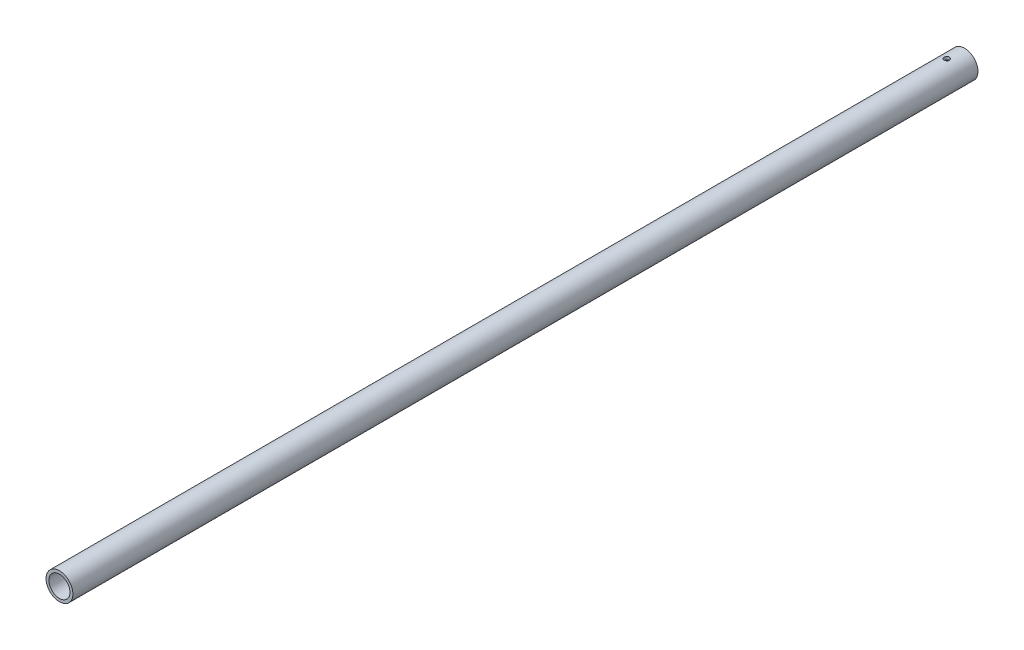
ISO-10303-21;
HEADER;
FILE_DESCRIPTION(('STEP AP214'),'2;1');
FILE_NAME('part.step','',(''),(''),'','','');
FILE_SCHEMA(('AUTOMOTIVE_DESIGN { 1 0 10303 214 1 1 1 1 }'));
ENDSEC;
DATA;
#1=APPLICATION_CONTEXT('core data for automotive mechanical design processes');
#2=APPLICATION_PROTOCOL_DEFINITION('international standard','automotive_design',2000,#1);
#3=PRODUCT_CONTEXT('',#1,'mechanical');
#4=PRODUCT('Part','Part','',(#3));
#5=PRODUCT_RELATED_PRODUCT_CATEGORY('part','',(#4));
#6=PRODUCT_DEFINITION_FORMATION('','',#4);
#7=PRODUCT_DEFINITION_CONTEXT('part definition',#1,'design');
#8=PRODUCT_DEFINITION('design','',#6,#7);
#9=PRODUCT_DEFINITION_SHAPE('','',#8);
#10=(LENGTH_UNIT() NAMED_UNIT(*) SI_UNIT(.MILLI.,.METRE.));
#11=(NAMED_UNIT(*) PLANE_ANGLE_UNIT() SI_UNIT($,.RADIAN.));
#12=(NAMED_UNIT(*) SI_UNIT($,.STERADIAN.) SOLID_ANGLE_UNIT());
#13=UNCERTAINTY_MEASURE_WITH_UNIT(LENGTH_MEASURE(1.E-05),#10,'distance_accuracy_value','');
#14=(GEOMETRIC_REPRESENTATION_CONTEXT(3) GLOBAL_UNCERTAINTY_ASSIGNED_CONTEXT((#13)) GLOBAL_UNIT_ASSIGNED_CONTEXT((#10,
#11,#12)) REPRESENTATION_CONTEXT('',''));
#15=CARTESIAN_POINT('',(0.,0.,0.));
#16=DIRECTION('',(0.,0.,1.));
#17=DIRECTION('',(1.,0.,0.));
#18=AXIS2_PLACEMENT_3D('',#15,#16,#17);
#19=CARTESIAN_POINT('',(-587.375,0.,44.448));
#20=DIRECTION('',(0.,0.,-1.));
#21=DIRECTION('',(0.,1.,0.));
#22=AXIS2_PLACEMENT_3D('',#19,#20,#21);
#23=CYLINDRICAL_SURFACE('',#22,13.0683);
#24=CARTESIAN_POINT('',(-587.375,2.22044604925031E-13,1168.4));
#25=DIRECTION('',(0.,0.,-1.));
#26=DIRECTION('',(0.,1.,0.));
#27=AXIS2_PLACEMENT_3D('',#24,#25,#26);
#28=CIRCLE('',#27,13.0683);
#29=CARTESIAN_POINT('',(-587.375,13.0683000000002,1168.4));
#30=VERTEX_POINT('',#29);
#31=EDGE_CURVE('E66',#30,#30,#28,.T.);
#32=ORIENTED_EDGE('',*,*,#31,.F.);
#33=EDGE_LOOP('',(#32));
#34=FACE_BOUND('',#33,.T.);
#35=CARTESIAN_POINT('',(-587.375,0.,44.45));
#36=DIRECTION('',(0.,0.,-1.));
#37=DIRECTION('',(0.,1.,0.));
#38=AXIS2_PLACEMENT_3D('',#35,#36,#37);
#39=CIRCLE('',#38,13.0683);
#40=CARTESIAN_POINT('',(-587.375,13.0683,44.45));
#41=VERTEX_POINT('',#40);
#42=EDGE_CURVE('E64',#41,#41,#39,.T.);
#43=ORIENTED_EDGE('',*,*,#42,.T.);
#44=EDGE_LOOP('',(#43));
#45=FACE_BOUND('',#44,.T.);
#46=CARTESIAN_POINT('',(-587.53833139634,13.0672794580307,63.3770418377689));
#47=CARTESIAN_POINT('',(-587.721100575177,13.0649918849138,63.3860987090218));
#48=CARTESIAN_POINT('',(-587.903125717905,13.0588464757121,63.4103905161322));
#49=CARTESIAN_POINT('',(-588.260354937121,13.0395046616244,63.4886492078556));
#50=CARTESIAN_POINT('',(-588.435554738759,13.0263039116557,63.5426343799399));
#51=CARTESIAN_POINT('',(-588.77396819349,12.9943149607709,63.6784535629161));
#52=CARTESIAN_POINT('',(-588.937197261757,12.975534108888,63.7602509652374));
#53=CARTESIAN_POINT('',(-589.247650307495,12.9343806292755,63.9493024055775));
#54=CARTESIAN_POINT('',(-589.394873854641,12.9120079050147,64.0565571277961));
#55=CARTESIAN_POINT('',(-589.672323929617,12.8655728852785,64.295980331765));
#56=CARTESIAN_POINT('',(-589.802160405314,12.8414860563161,64.4285962413922));
#57=CARTESIAN_POINT('',(-590.037940111511,12.7946746606322,64.7138281230409));
#58=CARTESIAN_POINT('',(-590.143881384593,12.7719502056239,64.8664457319194));
#59=CARTESIAN_POINT('',(-590.329824090898,12.7302272865214,65.1893146141167));
#60=CARTESIAN_POINT('',(-590.409554512781,12.7112685065847,65.3597274914947));
#61=CARTESIAN_POINT('',(-590.53906341514,12.679654978147,65.712125939414));
#62=CARTESIAN_POINT('',(-590.58884776111,12.6669989952097,65.8941092359479));
#63=CARTESIAN_POINT('',(-590.655924704754,12.649789709017,66.259743779684));
#64=CARTESIAN_POINT('',(-590.673980231583,12.6450462924839,66.4432460639722));
#65=CARTESIAN_POINT('',(-590.67932140654,12.6436521128186,66.8107149946973));
#66=CARTESIAN_POINT('',(-590.666611064706,12.6470002950238,66.9946815774951));
#67=CARTESIAN_POINT('',(-590.611467642253,12.6612206904028,67.3538266272606));
#68=CARTESIAN_POINT('',(-590.569661855967,12.6719340527542,67.5291084268457));
#69=CARTESIAN_POINT('',(-590.458350744913,12.6994753954826,67.8701289398293));
#70=CARTESIAN_POINT('',(-590.388842641932,12.7163039891297,68.0358666941648));
#71=CARTESIAN_POINT('',(-590.222872080421,12.7545059873789,68.3560282089219));
#72=CARTESIAN_POINT('',(-590.126001336057,12.7759469598428,68.5102319945485));
#73=CARTESIAN_POINT('',(-589.908452668902,12.8208576342404,68.800495447915));
#74=CARTESIAN_POINT('',(-589.787770561949,12.8443276923198,68.936551919734));
#75=CARTESIAN_POINT('',(-589.522037692798,12.8914454612849,69.1905800220592));
#76=CARTESIAN_POINT('',(-589.376403312444,12.9150800081957,69.3079445608181));
#77=CARTESIAN_POINT('',(-589.067095830384,12.9592301014388,69.516622096199));
#78=CARTESIAN_POINT('',(-588.903422957507,12.9797456873291,69.6079354232433));
#79=CARTESIAN_POINT('',(-588.562887862752,13.015321448744,69.7615721780566));
#80=CARTESIAN_POINT('',(-588.386057845694,13.0303944486118,69.8239638536427));
#81=CARTESIAN_POINT('',(-588.023965759115,13.0534354314761,69.9179949727274));
#82=CARTESIAN_POINT('',(-587.838705398,13.0614048473306,69.9496406180988));
#83=CARTESIAN_POINT('',(-587.470465198862,13.0692134660738,69.9806458710513));
#84=CARTESIAN_POINT('',(-587.287562148187,13.0692696369355,69.9808670855184));
#85=CARTESIAN_POINT('',(-586.924388130666,13.0617916131985,69.9511780752197));
#86=CARTESIAN_POINT('',(-586.744117009113,13.0542578665756,69.9212696287814));
#87=CARTESIAN_POINT('',(-586.393169602602,13.032539900263,69.8327896140948));
#88=CARTESIAN_POINT('',(-586.22241404998,13.0184244784369,69.7745142924446));
#89=CARTESIAN_POINT('',(-585.893057408581,12.9850583447726,69.6312330080142));
#90=CARTESIAN_POINT('',(-585.734457842766,12.9658069908288,69.5462237026547));
#91=CARTESIAN_POINT('',(-585.430131395502,12.9237024935997,69.3497352770919));
#92=CARTESIAN_POINT('',(-585.284761364524,12.9007798613018,69.237718533856));
#93=CARTESIAN_POINT('',(-585.014589863136,12.8540951157267,68.9912712702386));
#94=CARTESIAN_POINT('',(-584.88979177949,12.8303328650034,68.8568370665792));
#95=CARTESIAN_POINT('',(-584.661497546505,12.7840239470593,68.5657836440177));
#96=CARTESIAN_POINT('',(-584.558536210482,12.7615160110318,68.4087379277813));
#97=CARTESIAN_POINT('',(-584.380506156113,12.7209216856486,68.079029970687));
#98=CARTESIAN_POINT('',(-584.305434799374,12.702834878109,67.9063692089362));
#99=CARTESIAN_POINT('',(-584.186290321569,12.6734504080024,67.5523784229988));
#100=CARTESIAN_POINT('',(-584.141862176946,12.6620752178238,67.3711746054304));
#101=CARTESIAN_POINT('',(-584.084127536147,12.6471948096971,67.0035720865853));
#102=CARTESIAN_POINT('',(-584.070814505839,12.6436879394186,66.8171744843177));
#103=CARTESIAN_POINT('',(-584.075700142981,12.6449625118701,66.4502100803065));
#104=CARTESIAN_POINT('',(-584.09300324239,12.6495084036047,66.2696298094733));
#105=CARTESIAN_POINT('',(-584.156802638161,12.6658888096666,65.9140544486865));
#106=CARTESIAN_POINT('',(-584.20329939915,12.6777234399964,65.739059447671));
#107=CARTESIAN_POINT('',(-584.323984701052,12.7073049506421,65.3994652914132));
#108=CARTESIAN_POINT('',(-584.398171860142,12.7250515359311,65.234865617896));
#109=CARTESIAN_POINT('',(-584.572066926928,12.7644800387478,64.9202671978276));
#110=CARTESIAN_POINT('',(-584.671778777362,12.7861625640997,64.7702707119397));
#111=CARTESIAN_POINT('',(-584.897258118407,12.8317899206001,64.4845536549164));
#112=CARTESIAN_POINT('',(-585.023689003785,12.85578170639,64.3493638008059));
#113=CARTESIAN_POINT('',(-585.29744706586,12.9028483781541,64.1018628539771));
#114=CARTESIAN_POINT('',(-585.444778608573,12.9259230712608,63.989556553462));
#115=CARTESIAN_POINT('',(-585.758616044931,12.9689307393484,63.7895895845661));
#116=CARTESIAN_POINT('',(-585.925354810472,12.9888168802093,63.7022836846445));
#117=CARTESIAN_POINT('',(-586.271670025502,13.0227993236423,63.5571388483491));
#118=CARTESIAN_POINT('',(-586.45123670829,13.0368999770555,63.4992777607918));
#119=CARTESIAN_POINT('',(-586.782258214127,13.0556911874934,63.4230983554607));
#120=CARTESIAN_POINT('',(-586.93239796088,13.0616776141806,63.399282047039));
#121=CARTESIAN_POINT('',(-587.234639630717,13.068420249987,63.3724985258837));
#122=CARTESIAN_POINT('',(-587.386741430452,13.0691767863053,63.3695300088433));
#123=CARTESIAN_POINT('',(-587.53833139634,13.0672794580307,63.3770418377689));
#124=B_SPLINE_CURVE_WITH_KNOTS('',3,(#46,#47,#48,#49,#50,#51,#52,#53,#54,#55,#56,#57,#58,#59,
#60,#61,#62,#63,#64,#65,#66,#67,#68,#69,#70,#71,#72,#73,#74,#75,#76,#77,#78,#79,#80,#81,#82,#83,
#84,#85,#86,#87,#88,#89,#90,#91,#92,#93,#94,#95,#96,#97,#98,#99,#100,#101,#102,#103,#104,#105,
#106,#107,#108,#109,#110,#111,#112,#113,#114,#115,#116,#117,#118,#119,#120,#121,#122,#123),
.UNSPECIFIED.,.T.,.F.,(4,2,2,2,2,2,2,2,2,2,2,2,2,2,2,2,2,2,2,2,2,2,2,2,2,2,2,2,2,2,2,2,2,2,2,2,
2,2,4),(0.,0.54846367460348,1.09726551441117,1.64534775819881,2.19344473410384,2.75229291139326,
3.31118685111387,3.8756900209641,4.44008258635914,4.99070828918085,5.54126222707507,
6.08029981399044,6.6193914735787,7.16699553428746,7.71469590649142,8.27760490641119,
8.84050676631503,9.40207347149972,9.96352687787038,10.5095830869399,11.0556070683037,
11.5960472227399,12.1365549758874,12.6888690926608,13.2412740464139,13.8059507217746,
14.3705739650622,14.9285405014959,15.4863898551642,16.0281899579808,16.5699986839388,
17.1117803758291,17.6536458059419,18.2110022980092,18.7684753902674,19.3335062780449,
19.8981114652145,20.3530393268949,20.8079387265286),.UNSPECIFIED.);
#125=CARTESIAN_POINT('',(-587.53833139634,13.0672794580307,63.3770418377689));
#126=VERTEX_POINT('',#125);
#127=EDGE_CURVE('E16',#126,#126,#124,.T.);
#128=ORIENTED_EDGE('',*,*,#127,.T.);
#129=EDGE_LOOP('',(#128));
#130=FACE_BOUND('',#129,.T.);
#131=CARTESIAN_POINT('',(-587.211673948654,-13.0672795312399,63.3770415666532));
#132=CARTESIAN_POINT('',(-587.028904776288,-13.0649920335342,63.3860981400632));
#133=CARTESIAN_POINT('',(-586.846879614047,-13.0588466938023,63.4103896527));
#134=CARTESIAN_POINT('',(-586.489650302736,-13.0395050160975,63.4886477548916));
#135=CARTESIAN_POINT('',(-586.314450428486,-13.0263043330386,63.542632631925));
#136=CARTESIAN_POINT('',(-585.976036780042,-12.994315497913,63.6784512414632));
#137=CARTESIAN_POINT('',(-585.812807590757,-12.9755346948942,63.7602483654204));
#138=CARTESIAN_POINT('',(-585.502354259171,-12.9343812919573,63.9492992694329));
#139=CARTESIAN_POINT('',(-585.355130547178,-12.9120085955111,64.0565537336624));
#140=CARTESIAN_POINT('',(-585.077680100561,-12.8655736069627,64.2959764416947));
#141=CARTESIAN_POINT('',(-584.947843417043,-12.8414867808928,64.4285921136239));
#142=CARTESIAN_POINT('',(-584.712063256288,-12.7946753636715,64.7138235525568));
#143=CARTESIAN_POINT('',(-584.606121736512,-12.7719508842337,64.8664409564573));
#144=CARTESIAN_POINT('',(-584.420178482452,-12.7302278859752,65.1893094955277));
#145=CARTESIAN_POINT('',(-584.340447764008,-12.7112690517587,65.3597222380548));
#146=CARTESIAN_POINT('',(-584.210938249358,-12.6796553951483,65.7121204690211));
#147=CARTESIAN_POINT('',(-584.161153587682,-12.6669993383261,65.8941036834502));
#148=CARTESIAN_POINT('',(-584.094076007159,-12.6497898945543,66.2597381432175));
#149=CARTESIAN_POINT('',(-584.076020162878,-12.6450463954567,66.4432404249259));
#150=CARTESIAN_POINT('',(-584.070678362298,-12.6436520524858,66.8107094065577));
#151=CARTESIAN_POINT('',(-584.083388395925,-12.6470001539399,66.994676042834));
#152=CARTESIAN_POINT('',(-584.138531224017,-12.6612203999228,67.3538212235215));
#153=CARTESIAN_POINT('',(-584.180336719478,-12.6719336923103,67.5291031001822));
#154=CARTESIAN_POINT('',(-584.29164726759,-12.6994749116334,67.8701238133535));
#155=CARTESIAN_POINT('',(-584.361155098432,-12.7163034518355,68.035861690814));
#156=CARTESIAN_POINT('',(-584.527125122077,-12.7545053608499,68.3560234671489));
#157=CARTESIAN_POINT('',(-584.623995596674,-12.7759462971335,68.5102273942536));
#158=CARTESIAN_POINT('',(-584.841543746473,-12.820856923667,68.8004911731514));
#159=CARTESIAN_POINT('',(-584.962225605848,-12.8443269700673,68.9365478290275));
#160=CARTESIAN_POINT('',(-585.227958009704,-12.8914447431337,69.1905763529033));
#161=CARTESIAN_POINT('',(-585.373592174513,-12.9150793065232,69.3079411288295));
#162=CARTESIAN_POINT('',(-585.682899264363,-12.959229458669,69.5166191739795));
#163=CARTESIAN_POINT('',(-585.846571960603,-12.9797450869784,69.6079327735868));
#164=CARTESIAN_POINT('',(-586.187106782169,-13.0153209584984,69.7615701180032));
#165=CARTESIAN_POINT('',(-586.36393670519,-13.0303940249548,69.8239621049946));
#166=CARTESIAN_POINT('',(-586.726028660079,-13.0534351531659,69.9179938568394));
#167=CARTESIAN_POINT('',(-586.911288983531,-13.0614046477759,69.9496398235626));
#168=CARTESIAN_POINT('',(-587.279529170575,-13.0692134249071,69.9806457096701));
#169=CARTESIAN_POINT('',(-587.462432245302,-13.0692696751348,69.9808672352333));
#170=CARTESIAN_POINT('',(-587.825606364141,-13.0617918037916,69.9511788338225));
#171=CARTESIAN_POINT('',(-588.005877562959,-13.0542581302051,69.9212706852095));
#172=CARTESIAN_POINT('',(-588.356825140719,-13.0325402971673,69.8327912483358));
#173=CARTESIAN_POINT('',(-588.527580788148,-13.0184249368596,69.7745162118005));
#174=CARTESIAN_POINT('',(-588.856937663757,-12.9850589085635,69.6312354780594));
#175=CARTESIAN_POINT('',(-589.015537368989,-12.9658075984708,69.5462264382904));
#176=CARTESIAN_POINT('',(-589.319864121238,-12.9237031699551,69.3497385353725));
#177=CARTESIAN_POINT('',(-589.465234320489,-12.9007805623905,69.237722051406));
#178=CARTESIAN_POINT('',(-589.7354061998,-12.8540958406572,68.9912752802549));
#179=CARTESIAN_POINT('',(-589.860204493092,-12.8303335890377,68.8568413097761));
#180=CARTESIAN_POINT('',(-590.08849920139,-12.7840246395961,68.5657883102026));
#181=CARTESIAN_POINT('',(-590.19146080123,-12.761516672561,68.4087427808882));
#182=CARTESIAN_POINT('',(-590.369491413336,-12.7209222598184,68.0790351529219));
#183=CARTESIAN_POINT('',(-590.444563063949,-12.7028353959365,67.9063745333561));
#184=CARTESIAN_POINT('',(-590.563708160123,-12.6734507915638,67.5523839456585));
#185=CARTESIAN_POINT('',(-590.608136623496,-12.6620755248868,67.3711801828109));
#186=CARTESIAN_POINT('',(-590.665871903175,-12.6471949563732,67.0035777156241));
#187=CARTESIAN_POINT('',(-590.679185253633,-12.6436880022025,66.8171801103095));
#188=CARTESIAN_POINT('',(-590.674300237632,-12.6449624125072,66.4502156515015));
#189=CARTESIAN_POINT('',(-590.656997440757,-12.6495082255633,66.2696353305224));
#190=CARTESIAN_POINT('',(-590.593198632979,-12.6658884859085,65.9140598194657));
#191=CARTESIAN_POINT('',(-590.546702157485,-12.6777230491913,65.7390647183184));
#192=CARTESIAN_POINT('',(-590.426017414185,-12.7073044413492,65.399470352821));
#193=CARTESIAN_POINT('',(-590.351830533834,-12.7250509739946,65.2348705680866));
#194=CARTESIAN_POINT('',(-590.177936004792,-12.7644793930801,64.9202718822506));
#195=CARTESIAN_POINT('',(-590.078224413367,-12.7861618873473,64.7702752418041));
#196=CARTESIAN_POINT('',(-589.852745577599,-12.8317892045805,64.4845578377476));
#197=CARTESIAN_POINT('',(-589.726314938822,-12.8557809828225,64.3493677891864));
#198=CARTESIAN_POINT('',(-589.452557339908,-12.9028476663248,64.1018664131761));
#199=CARTESIAN_POINT('',(-589.305226013741,-12.9259223787231,63.9895598779297));
#200=CARTESIAN_POINT('',(-588.9913889484,-12.9689301149102,63.7895923817606));
#201=CARTESIAN_POINT('',(-588.824650333788,-12.9888163043157,63.7022861934083));
#202=CARTESIAN_POINT('',(-588.478335369236,-13.0227988651574,63.5571407572066));
#203=CARTESIAN_POINT('',(-588.298768785997,-13.0368995874026,63.4992793582763));
#204=CARTESIAN_POINT('',(-587.967747353501,-13.0556909342487,63.4230993680858));
#205=CARTESIAN_POINT('',(-587.817607588701,-13.0616774249776,63.3992827956927));
#206=CARTESIAN_POINT('',(-587.515365844413,-13.0684201932262,63.3724987542502));
#207=CARTESIAN_POINT('',(-587.36326398828,-13.0691767979581,63.3695299808408));
#208=CARTESIAN_POINT('',(-587.211673948654,-13.0672795312399,63.3770415666532));
#209=B_SPLINE_CURVE_WITH_KNOTS('',3,(#131,#132,#133,#134,#135,#136,#137,#138,#139,#140,#141,
#142,#143,#144,#145,#146,#147,#148,#149,#150,#151,#152,#153,#154,#155,#156,#157,#158,#159,#160,
#161,#162,#163,#164,#165,#166,#167,#168,#169,#170,#171,#172,#173,#174,#175,#176,#177,#178,#179,
#180,#181,#182,#183,#184,#185,#186,#187,#188,#189,#190,#191,#192,#193,#194,#195,#196,#197,#198,
#199,#200,#201,#202,#203,#204,#205,#206,#207,#208),.UNSPECIFIED.,.T.,.F.,(4,2,2,2,2,2,2,2,2,2,2,
2,2,2,2,2,2,2,2,2,2,2,2,2,2,2,2,2,2,2,2,2,2,2,2,2,2,2,4),(0.,0.548463608881046,1.09726538306532,
1.64534756218855,2.19344447286404,2.75229257721103,3.31118644502302,3.87568964223471,
4.44008223535803,4.99070802906428,5.5412620571766,6.08029965332341,6.61939132167977,
7.16699529962502,7.714695589164,8.27760453976244,8.84050635118009,9.40207311695606,
9.96352658392331,10.5095828652936,11.055606918359,11.5960470509461,12.1365547818619,
12.6888688158677,13.2412736871403,13.8059503397463,14.3705735611872,14.928540179275,
15.4863896142263,16.02818977316,16.5699985545698,17.1117801917757,17.6536455671415,
18.2110019787482,18.7684749907206,19.3335058947997,19.8981110998952,20.3530391456085,
20.8079387281155),.UNSPECIFIED.);
#210=CARTESIAN_POINT('',(-587.211673948654,-13.0672795312399,63.3770415666532));
#211=VERTEX_POINT('',#210);
#212=EDGE_CURVE('E67',#211,#211,#209,.T.);
#213=ORIENTED_EDGE('',*,*,#212,.T.);
#214=EDGE_LOOP('',(#213));
#215=FACE_BOUND('',#214,.T.);
#216=ADVANCED_FACE('F12',(#34,#45,#130,#215),#23,.F.);
#217=CARTESIAN_POINT('',(-587.375,3013.21950277304,66.675));
#218=DIRECTION('',(0.,1.,0.));
#219=DIRECTION('',(0.,0.,1.));
#220=AXIS2_PLACEMENT_3D('',#217,#218,#219);
#221=CYLINDRICAL_SURFACE('',#220,3.302);
#222=CARTESIAN_POINT('',(-587.538171175959,16.6997028822955,69.972965941776));
#223=CARTESIAN_POINT('',(-587.721892070882,16.697904415989,69.9638692036313));
#224=CARTESIAN_POINT('',(-587.904910189903,16.6930563957418,69.9393793308106));
#225=CARTESIAN_POINT('',(-588.264196285085,16.6777832395046,69.8603456935601));
#226=CARTESIAN_POINT('',(-588.440458426462,16.6673533941278,69.8057765500787));
#227=CARTESIAN_POINT('',(-588.781021334919,16.6420835388208,69.66832369699));
#228=CARTESIAN_POINT('',(-588.945333940704,16.6272479699427,69.5854684877485));
#229=CARTESIAN_POINT('',(-589.257733445142,16.5947797620309,69.3938424494471));
#230=CARTESIAN_POINT('',(-589.405821526184,16.577147327053,69.2850735107301));
#231=CARTESIAN_POINT('',(-589.683587224464,16.5407683136226,69.0431141764429));
#232=CARTESIAN_POINT('',(-589.813017153387,16.5220107348095,68.9096410017049));
#233=CARTESIAN_POINT('',(-590.047761532688,16.4856662850717,68.622793363847));
#234=CARTESIAN_POINT('',(-590.153074624549,16.468079480137,68.469417780374));
#235=CARTESIAN_POINT('',(-590.337127019633,16.4359763000385,68.1459921677601));
#236=CARTESIAN_POINT('',(-590.415711726956,16.4214779628236,67.9758522367177));
#237=CARTESIAN_POINT('',(-590.543074790194,16.3973850741711,67.6244335199473));
#238=CARTESIAN_POINT('',(-590.591856522747,16.387789967224,67.4431559986563));
#239=CARTESIAN_POINT('',(-590.657553844642,16.3747567247657,67.0775227754986));
#240=CARTESIAN_POINT('',(-590.674938344852,16.371228027836,66.8932545652645));
#241=CARTESIAN_POINT('',(-590.678715136658,16.3704665191972,66.5243967242396));
#242=CARTESIAN_POINT('',(-590.665109920192,16.3732332012658,66.3398071204851));
#243=CARTESIAN_POINT('',(-590.607715957117,16.3846596528574,65.9779314840779));
#244=CARTESIAN_POINT('',(-590.564302370801,16.3932461585377,65.8005833777632));
#245=CARTESIAN_POINT('',(-590.44902073495,16.4152525075172,65.4557118498909));
#246=CARTESIAN_POINT('',(-590.377150831082,16.4286726657922,65.2881890694094));
#247=CARTESIAN_POINT('',(-590.206202398062,16.4589966219682,64.965876607462));
#248=CARTESIAN_POINT('',(-590.106863143692,16.4759333933762,64.8112284098526));
#249=CARTESIAN_POINT('',(-589.884052628061,16.5113308593833,64.5206105835467));
#250=CARTESIAN_POINT('',(-589.760578745812,16.5297917193705,64.3846429862714));
#251=CARTESIAN_POINT('',(-589.490551137334,16.5665318609662,64.1328985400177));
#252=CARTESIAN_POINT('',(-589.343647210438,16.5848029951879,64.0174957570746));
#253=CARTESIAN_POINT('',(-589.032294115454,16.6188014855332,63.8129602851965));
#254=CARTESIAN_POINT('',(-588.867845186727,16.6345288763528,63.7238272379345));
#255=CARTESIAN_POINT('',(-588.52631063778,16.6616456971755,63.5746228661042));
#256=CARTESIAN_POINT('',(-588.349251785679,16.6730440090502,63.5144919692766));
#257=CARTESIAN_POINT('',(-587.987279243806,16.6902549930652,63.4249124815709));
#258=CARTESIAN_POINT('',(-587.802366512544,16.6960683447768,63.3954601577238));
#259=CARTESIAN_POINT('',(-587.433314449771,16.7014004949549,63.3684226260475));
#260=CARTESIAN_POINT('',(-587.249215668108,16.701024905452,63.3703027477458));
#261=CARTESIAN_POINT('',(-586.883998314759,16.6942797946029,63.4045629563483));
#262=CARTESIAN_POINT('',(-586.702879641379,16.6879104782222,63.4369420002898));
#263=CARTESIAN_POINT('',(-586.3497774095,16.6699346052581,63.5309075846624));
#264=CARTESIAN_POINT('',(-586.177747933875,16.658357906457,63.5923277123432));
#265=CARTESIAN_POINT('',(-585.846394217929,16.6312275521093,63.7424819338341));
#266=CARTESIAN_POINT('',(-585.687071092742,16.6156735480089,63.8312184216699));
#267=CARTESIAN_POINT('',(-585.383190659621,16.5820121079718,64.0349554451578));
#268=CARTESIAN_POINT('',(-585.238874806725,16.5638715874419,64.150310612135));
#269=CARTESIAN_POINT('',(-584.971470103551,16.5271896328336,64.4034046103127));
#270=CARTESIAN_POINT('',(-584.848383233771,16.5086481615309,64.5411455276026));
#271=CARTESIAN_POINT('',(-584.625343324275,16.4729791872897,64.8372351552411));
#272=CARTESIAN_POINT('',(-584.52570751704,16.4558728894619,64.9958256968418));
#273=CARTESIAN_POINT('',(-584.354532273569,16.4253180275156,65.3278347509708));
#274=CARTESIAN_POINT('',(-584.282990979417,16.4118692215419,65.5012522820529));
#275=CARTESIAN_POINT('',(-584.17068678887,16.3903125221169,65.8564764152847));
#276=CARTESIAN_POINT('',(-584.129666772098,16.3821600862273,66.038198922769));
#277=CARTESIAN_POINT('',(-584.078732135734,16.3719886015553,66.4061128565818));
#278=CARTESIAN_POINT('',(-584.068813831248,16.3699688261835,66.5923037508671));
#279=CARTESIAN_POINT('',(-584.080299607587,16.372283661976,66.9604829063408));
#280=CARTESIAN_POINT('',(-584.101172456358,16.3765105040751,67.1424886915075));
#281=CARTESIAN_POINT('',(-584.172609218268,16.3906284810949,67.5003423887959));
#282=CARTESIAN_POINT('',(-584.223173575893,16.400519700812,67.6761902086906));
#283=CARTESIAN_POINT('',(-584.35253707082,16.4248508516902,68.0170910494426));
#284=CARTESIAN_POINT('',(-584.431373928633,16.4392968566141,68.1821292988591));
#285=CARTESIAN_POINT('',(-584.615002814327,16.4711191658187,68.4967590656029));
#286=CARTESIAN_POINT('',(-584.719797119457,16.4884957271547,68.6463492260357));
#287=CARTESIAN_POINT('',(-584.954539629003,16.5245993499588,68.9286322716646));
#288=CARTESIAN_POINT('',(-585.08489619081,16.5433447324985,69.0609833773619));
#289=CARTESIAN_POINT('',(-585.366037233344,16.5798318597424,69.3020838051859));
#290=CARTESIAN_POINT('',(-585.516825994195,16.5975733930541,69.4108281697361));
#291=CARTESIAN_POINT('',(-585.835849606559,16.6302009662291,69.6022985895934));
#292=CARTESIAN_POINT('',(-586.004199433102,16.6450660995031,69.6848367552709));
#293=CARTESIAN_POINT('',(-586.352638853126,16.6700892840376,69.8202906283521));
#294=CARTESIAN_POINT('',(-586.532717333533,16.6802517192383,69.8732339342361));
#295=CARTESIAN_POINT('',(-586.850965875406,16.692825166247,69.9380661932478));
#296=CARTESIAN_POINT('',(-586.987672295395,16.6965732245035,69.9570978032207));
#297=CARTESIAN_POINT('',(-587.262441095348,16.7006858603097,69.9779556800816));
#298=CARTESIAN_POINT('',(-587.400503438845,16.7010505286087,69.9797824084388));
#299=CARTESIAN_POINT('',(-587.538171175959,16.6997028822955,69.972965941776));
#300=B_SPLINE_CURVE_WITH_KNOTS('',3,(#222,#223,#224,#225,#226,#227,#228,#229,#230,#231,#232,
#233,#234,#235,#236,#237,#238,#239,#240,#241,#242,#243,#244,#245,#246,#247,#248,#249,#250,#251,
#252,#253,#254,#255,#256,#257,#258,#259,#260,#261,#262,#263,#264,#265,#266,#267,#268,#269,#270,
#271,#272,#273,#274,#275,#276,#277,#278,#279,#280,#281,#282,#283,#284,#285,#286,#287,#288,#289,
#290,#291,#292,#293,#294,#295,#296,#297,#298,#299),.UNSPECIFIED.,.T.,.F.,(4,2,2,2,2,2,2,2,2,2,2,
2,2,2,2,2,2,2,2,2,2,2,2,2,2,2,2,2,2,2,2,2,2,2,2,2,2,2,4),(0.,0.551358359121057,1.10318263441878,
1.65445253772422,2.20568223955101,2.76366294606425,3.32167507625227,3.88286192201754,
4.44398517423648,4.99665660656469,5.54928359918618,6.09507987959915,6.64091173222767,
7.19211353745454,7.74337523573707,8.30381983003523,8.86425677935049,9.42353760050718,
9.98275036041307,10.5324303907709,11.0820916245652,11.628640641328,12.1752375716878,
12.7295863878436,13.2839868924582,13.8455038187605,14.4069836051843,14.9636780331087,
15.5203065020503,16.0674432221129,16.6145881330711,17.1624657644914,17.7103914782984,
18.2679124567826,18.8255504054473,19.3871005863031,19.9481262200848,20.3612871380901,
20.7744369742636),.UNSPECIFIED.);
#301=CARTESIAN_POINT('',(-587.538171175959,16.6997028822955,69.972965941776));
#302=VERTEX_POINT('',#301);
#303=EDGE_CURVE('E36',#302,#302,#300,.T.);
#304=ORIENTED_EDGE('',*,*,#303,.F.);
#305=EDGE_LOOP('',(#304));
#306=FACE_BOUND('',#305,.T.);
#307=ORIENTED_EDGE('',*,*,#127,.F.);
#308=EDGE_LOOP('',(#307));
#309=FACE_BOUND('',#308,.T.);
#310=ADVANCED_FACE('F58',(#306,#309),#221,.F.);
#311=CARTESIAN_POINT('',(-587.375,3013.21950277304,66.675));
#312=DIRECTION('',(0.,1.,0.));
#313=DIRECTION('',(0.,0.,1.));
#314=AXIS2_PLACEMENT_3D('',#311,#312,#313);
#315=CYLINDRICAL_SURFACE('',#314,3.302);
#316=CARTESIAN_POINT('',(-587.538171175959,-16.6997028822955,63.3770340582239));
#317=CARTESIAN_POINT('',(-587.721892070882,-16.697904415989,63.3861307963686));
#318=CARTESIAN_POINT('',(-587.904910189902,-16.6930563957416,63.4106206691893));
#319=CARTESIAN_POINT('',(-588.264196285085,-16.6777832395045,63.4896543064398));
#320=CARTESIAN_POINT('',(-588.440458426462,-16.6673533941281,63.5442234499212));
#321=CARTESIAN_POINT('',(-588.781021334919,-16.642083538821,63.6816763030099));
#322=CARTESIAN_POINT('',(-588.945333940703,-16.6272479699425,63.7645315122515));
#323=CARTESIAN_POINT('',(-589.257733445142,-16.5947797620307,63.9561575505528));
#324=CARTESIAN_POINT('',(-589.405821526184,-16.5771473270532,64.0649264892698));
#325=CARTESIAN_POINT('',(-589.683587224464,-16.5407683136229,64.306885823557));
#326=CARTESIAN_POINT('',(-589.813017153387,-16.5220107348094,64.440358998295));
#327=CARTESIAN_POINT('',(-590.047761532688,-16.4856662850715,64.7272066361528));
#328=CARTESIAN_POINT('',(-590.153074624549,-16.4680794801372,64.8805822196258));
#329=CARTESIAN_POINT('',(-590.337127019633,-16.4359763000387,65.2040078322397));
#330=CARTESIAN_POINT('',(-590.415711726956,-16.4214779628234,65.3741477632821));
#331=CARTESIAN_POINT('',(-590.543074790194,-16.3973850741709,65.7255664800525));
#332=CARTESIAN_POINT('',(-590.591856522747,-16.3877899672242,65.9068440013435));
#333=CARTESIAN_POINT('',(-590.657553844642,-16.374756724766,66.2724772245013));
#334=CARTESIAN_POINT('',(-590.674938344852,-16.3712280278358,66.4567454347354));
#335=CARTESIAN_POINT('',(-590.678715136658,-16.370466519197,66.8256032757603));
#336=CARTESIAN_POINT('',(-590.665109920192,-16.373233201266,67.0101928795147));
#337=CARTESIAN_POINT('',(-590.607715957117,-16.3846596528576,67.372068515922));
#338=CARTESIAN_POINT('',(-590.564302370801,-16.3932461585375,67.5494166222367));
#339=CARTESIAN_POINT('',(-590.44902073495,-16.415252507517,67.894288150109));
#340=CARTESIAN_POINT('',(-590.377150831082,-16.4286726657924,68.0618109305905));
#341=CARTESIAN_POINT('',(-590.206202398062,-16.4589966219684,68.3841233925379));
#342=CARTESIAN_POINT('',(-590.106863143692,-16.475933393376,68.5387715901472));
#343=CARTESIAN_POINT('',(-589.884052628061,-16.5113308593831,68.8293894164532));
#344=CARTESIAN_POINT('',(-589.760578745812,-16.5297917193707,68.9653570137285));
#345=CARTESIAN_POINT('',(-589.490551137334,-16.5665318609664,69.2171014599822));
#346=CARTESIAN_POINT('',(-589.343647210438,-16.5848029951878,69.3325042429253));
#347=CARTESIAN_POINT('',(-589.032294115454,-16.618801485533,69.5370397148034));
#348=CARTESIAN_POINT('',(-588.867845186727,-16.6345288763531,69.6261727620654));
#349=CARTESIAN_POINT('',(-588.526310637781,-16.6616456971757,69.7753771338958));
#350=CARTESIAN_POINT('',(-588.349251785679,-16.6730440090501,69.8355080307234));
#351=CARTESIAN_POINT('',(-587.987279243806,-16.690254993065,69.925087518429));
#352=CARTESIAN_POINT('',(-587.802366512544,-16.696068344777,69.9545398422762));
#353=CARTESIAN_POINT('',(-587.433314449771,-16.7014004949551,69.9815773739525));
#354=CARTESIAN_POINT('',(-587.249215668108,-16.7010249054519,69.9796972522541));
#355=CARTESIAN_POINT('',(-586.883998314759,-16.6942797946027,69.9454370436517));
#356=CARTESIAN_POINT('',(-586.702879641379,-16.6879104782225,69.9130579997102));
#357=CARTESIAN_POINT('',(-586.3497774095,-16.6699346052583,69.8190924153376));
#358=CARTESIAN_POINT('',(-586.177747933875,-16.6583579064569,69.7576722876568));
#359=CARTESIAN_POINT('',(-585.846394217929,-16.6312275521091,69.6075180661659));
#360=CARTESIAN_POINT('',(-585.687071092742,-16.6156735480091,69.51878157833));
#361=CARTESIAN_POINT('',(-585.383190659621,-16.582012107972,69.3150445548421));
#362=CARTESIAN_POINT('',(-585.238874806725,-16.5638715874417,69.199689387865));
#363=CARTESIAN_POINT('',(-584.971470103551,-16.5271896328334,68.9465953896873));
#364=CARTESIAN_POINT('',(-584.848383233771,-16.5086481615311,68.8088544723974));
#365=CARTESIAN_POINT('',(-584.625343324275,-16.4729791872899,68.5127648447589));
#366=CARTESIAN_POINT('',(-584.52570751704,-16.4558728894617,68.3541743031582));
#367=CARTESIAN_POINT('',(-584.354532273569,-16.4253180275154,68.0221652490292));
#368=CARTESIAN_POINT('',(-584.282990979417,-16.4118692215421,67.8487477179471));
#369=CARTESIAN_POINT('',(-584.17068678887,-16.3903125221171,67.4935235847153));
#370=CARTESIAN_POINT('',(-584.129666772098,-16.3821600862272,67.3118010772311));
#371=CARTESIAN_POINT('',(-584.078732135734,-16.3719886015552,66.9438871434184));
#372=CARTESIAN_POINT('',(-584.068813831248,-16.3699688261837,66.757696249133));
#373=CARTESIAN_POINT('',(-584.080299607587,-16.3722836619762,66.3895170936593));
#374=CARTESIAN_POINT('',(-584.101172456358,-16.3765105040749,66.2075113084927));
#375=CARTESIAN_POINT('',(-584.172609218268,-16.3906284810948,65.8496576112042));
#376=CARTESIAN_POINT('',(-584.223173575893,-16.4005197008122,65.6738097913095));
#377=CARTESIAN_POINT('',(-584.35253707082,-16.4248508516904,65.3329089505575));
#378=CARTESIAN_POINT('',(-584.431373928633,-16.4392968566139,65.167870701141));
#379=CARTESIAN_POINT('',(-584.615002814327,-16.4711191658185,64.8532409343973));
#380=CARTESIAN_POINT('',(-584.719797119456,-16.4884957271549,64.7036507739645));
#381=CARTESIAN_POINT('',(-584.954539629003,-16.524599349959,64.4213677283355));
#382=CARTESIAN_POINT('',(-585.08489619081,-16.5433447324983,64.2890166226382));
#383=CARTESIAN_POINT('',(-585.366037233344,-16.5798318597422,64.0479161948141));
#384=CARTESIAN_POINT('',(-585.516825994194,-16.5975733930543,63.9391718302639));
#385=CARTESIAN_POINT('',(-585.835849606559,-16.6302009662293,63.7477014104066));
#386=CARTESIAN_POINT('',(-586.004199433102,-16.6450660995029,63.6651632447291));
#387=CARTESIAN_POINT('',(-586.352638853126,-16.6700892840374,63.5297093716479));
#388=CARTESIAN_POINT('',(-586.532717333533,-16.6802517192386,63.476766065764));
#389=CARTESIAN_POINT('',(-586.850965875406,-16.6928251662471,63.4119338067522));
#390=CARTESIAN_POINT('',(-586.987672295395,-16.6965732245033,63.3929021967792));
#391=CARTESIAN_POINT('',(-587.262441095348,-16.7006858603094,63.3720443199183));
#392=CARTESIAN_POINT('',(-587.400503438845,-16.7010505286086,63.3702175915611));
#393=CARTESIAN_POINT('',(-587.538171175959,-16.6997028822955,63.3770340582239));
#394=B_SPLINE_CURVE_WITH_KNOTS('',3,(#316,#317,#318,#319,#320,#321,#322,#323,#324,#325,#326,
#327,#328,#329,#330,#331,#332,#333,#334,#335,#336,#337,#338,#339,#340,#341,#342,#343,#344,#345,
#346,#347,#348,#349,#350,#351,#352,#353,#354,#355,#356,#357,#358,#359,#360,#361,#362,#363,#364,
#365,#366,#367,#368,#369,#370,#371,#372,#373,#374,#375,#376,#377,#378,#379,#380,#381,#382,#383,
#384,#385,#386,#387,#388,#389,#390,#391,#392,#393),.UNSPECIFIED.,.T.,.F.,(4,2,2,2,2,2,2,2,2,2,2,
2,2,2,2,2,2,2,2,2,2,2,2,2,2,2,2,2,2,2,2,2,2,2,2,2,2,2,4),(0.,0.551358359121058,1.10318263441875,
1.65445253772411,2.20568223955097,2.76366294606422,3.32167507625214,3.88286192201745,
4.44398517423644,4.99665660656469,5.54928359918621,6.09507987959917,6.64091173222771,
7.1921135374545,7.74337523573704,8.30381983003513,8.86425677935035,9.42353760050712,
9.98275036041292,10.5324303907709,11.0820916245652,11.628640641328,12.1752375716879,
12.7295863878437,13.2839868924583,13.8455038187605,14.4069836051843,14.9636780331086,
15.5203065020503,16.0674432221128,16.614588133071,17.1624657644913,17.7103914782983,
18.2679124567825,18.8255504054473,19.387100586303,19.9481262200847,20.3612871380902,
20.7744369742635),.UNSPECIFIED.);
#395=CARTESIAN_POINT('',(-587.538171175959,-16.6997028822955,63.3770340582239));
#396=VERTEX_POINT('',#395);
#397=EDGE_CURVE('E27',#396,#396,#394,.T.);
#398=ORIENTED_EDGE('',*,*,#397,.F.);
#399=EDGE_LOOP('',(#398));
#400=FACE_BOUND('',#399,.T.);
#401=ORIENTED_EDGE('',*,*,#212,.F.);
#402=EDGE_LOOP('',(#401));
#403=FACE_BOUND('',#402,.T.);
#404=ADVANCED_FACE('F40',(#400,#403),#315,.F.);
#405=CARTESIAN_POINT('',(-1.11022302462516E-13,155.575,44.4499999999999));
#406=DIRECTION('',(0.,0.,1.));
#407=DIRECTION('',(0.,-1.,0.));
#408=AXIS2_PLACEMENT_3D('',#405,#406,#407);
#409=PLANE('',#408);
#410=CARTESIAN_POINT('',(-587.375,0.,44.4500000000001));
#411=DIRECTION('',(0.,0.,1.));
#412=DIRECTION('',(0.,-1.,0.));
#413=AXIS2_PLACEMENT_3D('',#410,#411,#412);
#414=CIRCLE('',#413,16.7005);
#415=CARTESIAN_POINT('',(-587.375,-16.7005,44.4500000000001));
#416=VERTEX_POINT('',#415);
#417=EDGE_CURVE('E22',#416,#416,#414,.T.);
#418=ORIENTED_EDGE('',*,*,#417,.F.);
#419=EDGE_LOOP('',(#418));
#420=FACE_BOUND('',#419,.T.);
#421=ORIENTED_EDGE('',*,*,#42,.F.);
#422=EDGE_LOOP('',(#421));
#423=FACE_BOUND('',#422,.T.);
#424=ADVANCED_FACE('F50',(#420,#423),#409,.F.);
#425=CARTESIAN_POINT('',(-587.375,155.575,1168.4));
#426=DIRECTION('',(0.,0.,1.));
#427=DIRECTION('',(0.,-1.,0.));
#428=AXIS2_PLACEMENT_3D('',#425,#426,#427);
#429=PLANE('',#428);
#430=CARTESIAN_POINT('',(-587.375,2.22044604925031E-13,1168.4));
#431=DIRECTION('',(0.,0.,1.));
#432=DIRECTION('',(0.,-1.,0.));
#433=AXIS2_PLACEMENT_3D('',#430,#431,#432);
#434=CIRCLE('',#433,16.7005);
#435=CARTESIAN_POINT('',(-587.375,-16.7004999999998,1168.4));
#436=VERTEX_POINT('',#435);
#437=EDGE_CURVE('E8',#436,#436,#434,.F.);
#438=ORIENTED_EDGE('',*,*,#437,.F.);
#439=EDGE_LOOP('',(#438));
#440=FACE_BOUND('',#439,.T.);
#441=ORIENTED_EDGE('',*,*,#31,.T.);
#442=EDGE_LOOP('',(#441));
#443=FACE_BOUND('',#442,.T.);
#444=ADVANCED_FACE('F47',(#440,#443),#429,.T.);
#445=CARTESIAN_POINT('',(-587.375,2.22044604925031E-13,1168.4));
#446=DIRECTION('',(0.,0.,1.));
#447=DIRECTION('',(0.,-1.,0.));
#448=AXIS2_PLACEMENT_3D('',#445,#446,#447);
#449=CYLINDRICAL_SURFACE('',#448,16.7005);
#450=ORIENTED_EDGE('',*,*,#437,.T.);
#451=EDGE_LOOP('',(#450));
#452=FACE_BOUND('',#451,.T.);
#453=ORIENTED_EDGE('',*,*,#417,.T.);
#454=EDGE_LOOP('',(#453));
#455=FACE_BOUND('',#454,.T.);
#456=ORIENTED_EDGE('',*,*,#397,.T.);
#457=EDGE_LOOP('',(#456));
#458=FACE_BOUND('',#457,.T.);
#459=ORIENTED_EDGE('',*,*,#303,.T.);
#460=EDGE_LOOP('',(#459));
#461=FACE_BOUND('',#460,.T.);
#462=ADVANCED_FACE('F43',(#452,#455,#458,#461),#449,.T.);
#463=CLOSED_SHELL('',(#216,#310,#404,#424,#444,#462));
#464=MANIFOLD_SOLID_BREP('B1',#463);
#465=ADVANCED_BREP_SHAPE_REPRESENTATION('',(#18,#464),#14);
#466=SHAPE_DEFINITION_REPRESENTATION(#9,#465);
ENDSEC;
END-ISO-10303-21;
